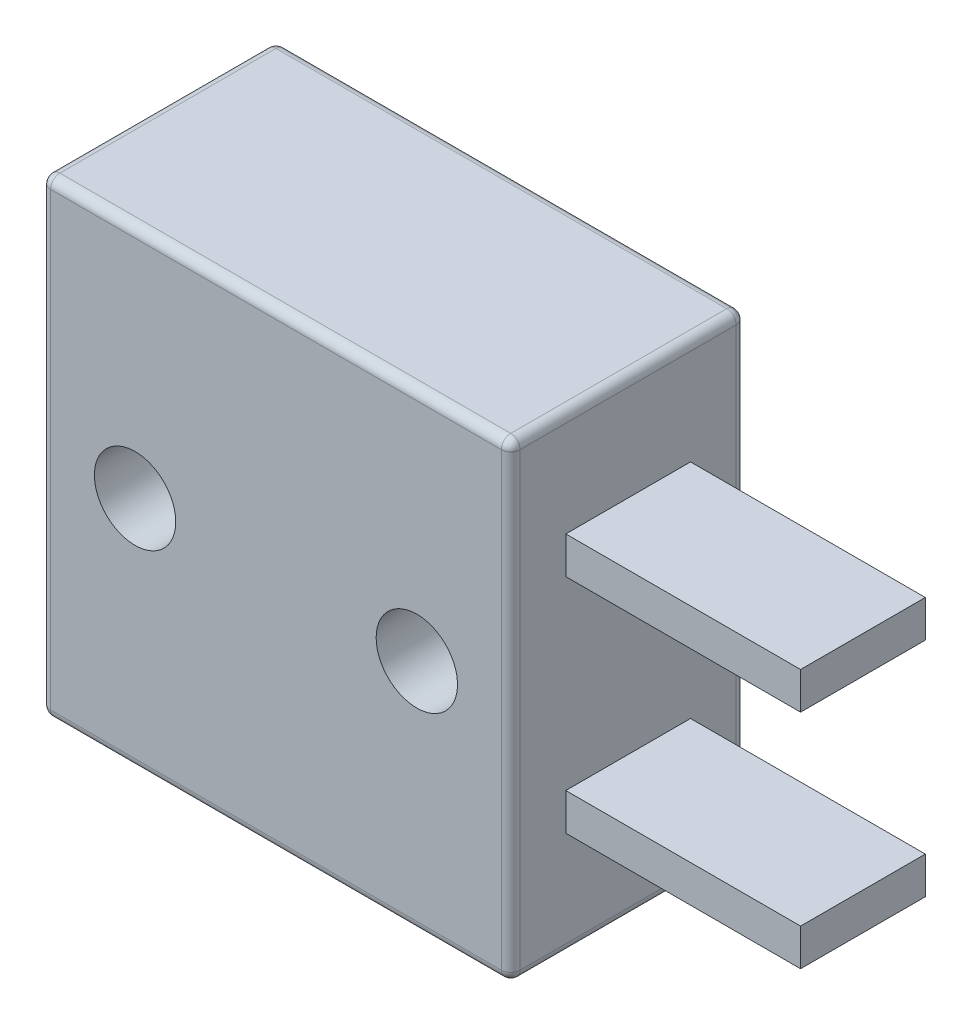
ISO-10303-21;
HEADER;
FILE_DESCRIPTION(('STEP AP214'),'2;1');
FILE_NAME('part.step','',(''),(''),'','','');
FILE_SCHEMA(('AUTOMOTIVE_DESIGN { 1 0 10303 214 1 1 1 1 }'));
ENDSEC;
DATA;
#1=APPLICATION_CONTEXT('core data for automotive mechanical design processes');
#2=APPLICATION_PROTOCOL_DEFINITION('international standard','automotive_design',2000,#1);
#3=PRODUCT_CONTEXT('',#1,'mechanical');
#4=PRODUCT('Part','Part','',(#3));
#5=PRODUCT_RELATED_PRODUCT_CATEGORY('part','',(#4));
#6=PRODUCT_DEFINITION_FORMATION('','',#4);
#7=PRODUCT_DEFINITION_CONTEXT('part definition',#1,'design');
#8=PRODUCT_DEFINITION('design','',#6,#7);
#9=PRODUCT_DEFINITION_SHAPE('','',#8);
#10=(LENGTH_UNIT() NAMED_UNIT(*) SI_UNIT(.MILLI.,.METRE.));
#11=(NAMED_UNIT(*) PLANE_ANGLE_UNIT() SI_UNIT($,.RADIAN.));
#12=(NAMED_UNIT(*) SI_UNIT($,.STERADIAN.) SOLID_ANGLE_UNIT());
#13=UNCERTAINTY_MEASURE_WITH_UNIT(LENGTH_MEASURE(1.E-05),#10,'distance_accuracy_value','');
#14=(GEOMETRIC_REPRESENTATION_CONTEXT(3) GLOBAL_UNCERTAINTY_ASSIGNED_CONTEXT((#13)) GLOBAL_UNIT_ASSIGNED_CONTEXT((#10,
#11,#12)) REPRESENTATION_CONTEXT('',''));
#15=CARTESIAN_POINT('',(0.,0.,0.));
#16=DIRECTION('',(0.,0.,1.));
#17=DIRECTION('',(1.,0.,0.));
#18=AXIS2_PLACEMENT_3D('',#15,#16,#17);
#19=CARTESIAN_POINT('',(0.,0.,6.35));
#20=DIRECTION('',(0.,0.,1.));
#21=DIRECTION('',(1.,0.,0.));
#22=AXIS2_PLACEMENT_3D('',#19,#20,#21);
#23=PLANE('',#22);
#24=DIRECTION('',(0.,-1.,0.));
#25=VECTOR('',#24,1.);
#26=CARTESIAN_POINT('',(-6.096,-6.35,6.35));
#27=LINE('',#26,#25);
#28=CARTESIAN_POINT('',(-6.096,6.096,6.35));
#29=VERTEX_POINT('',#28);
#30=CARTESIAN_POINT('',(-6.096,-6.096,6.35));
#31=VERTEX_POINT('',#30);
#32=EDGE_CURVE('E286',#29,#31,#27,.T.);
#33=ORIENTED_EDGE('',*,*,#32,.T.);
#34=DIRECTION('',(1.,0.,0.));
#35=VECTOR('',#34,1.);
#36=CARTESIAN_POINT('',(6.35,-6.096,6.35));
#37=LINE('',#36,#35);
#38=CARTESIAN_POINT('',(6.096,-6.096,6.35));
#39=VERTEX_POINT('',#38);
#40=EDGE_CURVE('E290',#31,#39,#37,.T.);
#41=ORIENTED_EDGE('',*,*,#40,.T.);
#42=DIRECTION('',(0.,1.,0.));
#43=VECTOR('',#42,1.);
#44=CARTESIAN_POINT('',(6.096,6.35,6.35));
#45=LINE('',#44,#43);
#46=CARTESIAN_POINT('',(6.096,6.096,6.35));
#47=VERTEX_POINT('',#46);
#48=EDGE_CURVE('E288',#39,#47,#45,.T.);
#49=ORIENTED_EDGE('',*,*,#48,.T.);
#50=DIRECTION('',(-1.,0.,0.));
#51=VECTOR('',#50,1.);
#52=CARTESIAN_POINT('',(-6.35,6.096,6.35));
#53=LINE('',#52,#51);
#54=EDGE_CURVE('E284',#47,#29,#53,.T.);
#55=ORIENTED_EDGE('',*,*,#54,.T.);
#56=EDGE_LOOP('',(#33,#41,#49,#55));
#57=FACE_BOUND('',#56,.T.);
#58=CARTESIAN_POINT('',(-3.81,0.,6.35));
#59=DIRECTION('',(0.,0.,1.));
#60=DIRECTION('',(1.,0.,0.));
#61=AXIS2_PLACEMENT_3D('',#58,#59,#60);
#62=CIRCLE('',#61,1.1);
#63=CARTESIAN_POINT('',(-2.71,0.,6.35));
#64=VERTEX_POINT('',#63);
#65=EDGE_CURVE('E243',#64,#64,#62,.T.);
#66=ORIENTED_EDGE('',*,*,#65,.F.);
#67=EDGE_LOOP('',(#66));
#68=FACE_BOUND('',#67,.T.);
#69=CARTESIAN_POINT('',(3.81,0.,6.35));
#70=DIRECTION('',(0.,0.,1.));
#71=DIRECTION('',(-1.,0.,0.));
#72=AXIS2_PLACEMENT_3D('',#69,#70,#71);
#73=CIRCLE('',#72,1.1);
#74=CARTESIAN_POINT('',(2.71,0.,6.35));
#75=VERTEX_POINT('',#74);
#76=EDGE_CURVE('E237',#75,#75,#73,.T.);
#77=ORIENTED_EDGE('',*,*,#76,.F.);
#78=EDGE_LOOP('',(#77));
#79=FACE_BOUND('',#78,.T.);
#80=ADVANCED_FACE('F39',(#57,#68,#79),#23,.T.);
#81=CARTESIAN_POINT('',(0.,0.,0.));
#82=DIRECTION('',(0.,0.,1.));
#83=DIRECTION('',(1.,0.,0.));
#84=AXIS2_PLACEMENT_3D('',#81,#82,#83);
#85=PLANE('',#84);
#86=DIRECTION('',(1.,0.,0.));
#87=VECTOR('',#86,1.);
#88=CARTESIAN_POINT('',(0.,-6.096,0.));
#89=LINE('',#88,#87);
#90=CARTESIAN_POINT('',(6.096,-6.096,0.));
#91=VERTEX_POINT('',#90);
#92=CARTESIAN_POINT('',(-6.096,-6.096,0.));
#93=VERTEX_POINT('',#92);
#94=EDGE_CURVE('E261',#91,#93,#89,.F.);
#95=ORIENTED_EDGE('',*,*,#94,.T.);
#96=DIRECTION('',(0.,-1.,0.));
#97=VECTOR('',#96,1.);
#98=CARTESIAN_POINT('',(-6.096,0.,0.));
#99=LINE('',#98,#97);
#100=CARTESIAN_POINT('',(-6.096,6.096,0.));
#101=VERTEX_POINT('',#100);
#102=EDGE_CURVE('E263',#93,#101,#99,.F.);
#103=ORIENTED_EDGE('',*,*,#102,.T.);
#104=DIRECTION('',(-1.,0.,0.));
#105=VECTOR('',#104,1.);
#106=CARTESIAN_POINT('',(0.,6.096,0.));
#107=LINE('',#106,#105);
#108=CARTESIAN_POINT('',(6.096,6.096,0.));
#109=VERTEX_POINT('',#108);
#110=EDGE_CURVE('E257',#101,#109,#107,.F.);
#111=ORIENTED_EDGE('',*,*,#110,.T.);
#112=DIRECTION('',(0.,1.,0.));
#113=VECTOR('',#112,1.);
#114=CARTESIAN_POINT('',(6.096,0.,0.));
#115=LINE('',#114,#113);
#116=EDGE_CURVE('E259',#109,#91,#115,.F.);
#117=ORIENTED_EDGE('',*,*,#116,.T.);
#118=EDGE_LOOP('',(#95,#103,#111,#117));
#119=FACE_BOUND('',#118,.T.);
#120=CARTESIAN_POINT('',(-3.81,0.,0.));
#121=DIRECTION('',(0.,0.,1.));
#122=DIRECTION('',(1.,0.,0.));
#123=AXIS2_PLACEMENT_3D('',#120,#121,#122);
#124=CIRCLE('',#123,1.1);
#125=CARTESIAN_POINT('',(-2.71,0.,0.));
#126=VERTEX_POINT('',#125);
#127=EDGE_CURVE('E240',#126,#126,#124,.T.);
#128=ORIENTED_EDGE('',*,*,#127,.T.);
#129=EDGE_LOOP('',(#128));
#130=FACE_BOUND('',#129,.T.);
#131=CARTESIAN_POINT('',(3.81,0.,0.));
#132=DIRECTION('',(0.,0.,1.));
#133=DIRECTION('',(-1.,0.,0.));
#134=AXIS2_PLACEMENT_3D('',#131,#132,#133);
#135=CIRCLE('',#134,1.1);
#136=CARTESIAN_POINT('',(2.71,0.,0.));
#137=VERTEX_POINT('',#136);
#138=EDGE_CURVE('E236',#137,#137,#135,.T.);
#139=ORIENTED_EDGE('',*,*,#138,.T.);
#140=EDGE_LOOP('',(#139));
#141=FACE_BOUND('',#140,.T.);
#142=ADVANCED_FACE('F400',(#119,#130,#141),#85,.F.);
#143=CARTESIAN_POINT('',(6.35,6.35,6.35));
#144=DIRECTION('',(-1.,0.,0.));
#145=DIRECTION('',(0.,0.,1.));
#146=AXIS2_PLACEMENT_3D('',#143,#144,#145);
#147=PLANE('',#146);
#148=DIRECTION('',(0.,0.,-1.));
#149=VECTOR('',#148,1.);
#150=CARTESIAN_POINT('',(6.35,-6.096,6.35));
#151=LINE('',#150,#149);
#152=CARTESIAN_POINT('',(6.35,-6.096,6.096));
#153=VERTEX_POINT('',#152);
#154=CARTESIAN_POINT('',(6.35,-6.096,0.254));
#155=VERTEX_POINT('',#154);
#156=EDGE_CURVE('E279',#153,#155,#151,.T.);
#157=ORIENTED_EDGE('',*,*,#156,.T.);
#158=DIRECTION('',(0.,1.,0.));
#159=VECTOR('',#158,1.);
#160=CARTESIAN_POINT('',(6.35,6.35,0.254));
#161=LINE('',#160,#159);
#162=CARTESIAN_POINT('',(6.35,6.096,0.254));
#163=VERTEX_POINT('',#162);
#164=EDGE_CURVE('E281',#155,#163,#161,.T.);
#165=ORIENTED_EDGE('',*,*,#164,.T.);
#166=DIRECTION('',(0.,0.,-1.));
#167=VECTOR('',#166,1.);
#168=CARTESIAN_POINT('',(6.35,6.096,6.35));
#169=LINE('',#168,#167);
#170=CARTESIAN_POINT('',(6.35,6.096,6.096));
#171=VERTEX_POINT('',#170);
#172=EDGE_CURVE('E275',#163,#171,#169,.F.);
#173=ORIENTED_EDGE('',*,*,#172,.T.);
#174=DIRECTION('',(0.,1.,0.));
#175=VECTOR('',#174,1.);
#176=CARTESIAN_POINT('',(6.35,-6.35,6.096));
#177=LINE('',#176,#175);
#178=EDGE_CURVE('E277',#171,#153,#177,.F.);
#179=ORIENTED_EDGE('',*,*,#178,.T.);
#180=EDGE_LOOP('',(#157,#165,#173,#179));
#181=FACE_BOUND('',#180,.T.);
#182=DIRECTION('',(0.,0.,-1.));
#183=VECTOR('',#182,1.);
#184=CARTESIAN_POINT('',(6.35,-3.5048,4.86171875));
#185=LINE('',#184,#183);
#186=CARTESIAN_POINT('',(6.35,-3.5048,4.86171875));
#187=VERTEX_POINT('',#186);
#188=CARTESIAN_POINT('',(6.35,-3.5048,1.48828125));
#189=VERTEX_POINT('',#188);
#190=EDGE_CURVE('E378',#187,#189,#185,.T.);
#191=ORIENTED_EDGE('',*,*,#190,.F.);
#192=DIRECTION('',(0.,-1.,0.));
#193=VECTOR('',#192,1.);
#194=CARTESIAN_POINT('',(6.35,-3.5048,4.86171875));
#195=LINE('',#194,#193);
#196=CARTESIAN_POINT('',(6.35,-2.5048,4.86171875));
#197=VERTEX_POINT('',#196);
#198=EDGE_CURVE('E193',#197,#187,#195,.T.);
#199=ORIENTED_EDGE('',*,*,#198,.F.);
#200=DIRECTION('',(0.,0.,-1.));
#201=VECTOR('',#200,1.);
#202=CARTESIAN_POINT('',(6.35,-2.5048,4.86171875));
#203=LINE('',#202,#201);
#204=CARTESIAN_POINT('',(6.35,-2.5048,1.48828125));
#205=VERTEX_POINT('',#204);
#206=EDGE_CURVE('E205',#197,#205,#203,.T.);
#207=ORIENTED_EDGE('',*,*,#206,.T.);
#208=DIRECTION('',(0.,-1.,0.));
#209=VECTOR('',#208,1.);
#210=CARTESIAN_POINT('',(6.35,-3.5048,1.48828125));
#211=LINE('',#210,#209);
#212=EDGE_CURVE('E196',#205,#189,#211,.T.);
#213=ORIENTED_EDGE('',*,*,#212,.T.);
#214=EDGE_LOOP('',(#191,#199,#207,#213));
#215=FACE_BOUND('',#214,.T.);
#216=DIRECTION('',(0.,0.,-1.));
#217=VECTOR('',#216,1.);
#218=CARTESIAN_POINT('',(6.35,2.5048,4.86171875));
#219=LINE('',#218,#217);
#220=CARTESIAN_POINT('',(6.35,2.5048,4.86171875));
#221=VERTEX_POINT('',#220);
#222=CARTESIAN_POINT('',(6.35,2.5048,1.48828125));
#223=VERTEX_POINT('',#222);
#224=EDGE_CURVE('E233',#221,#223,#219,.T.);
#225=ORIENTED_EDGE('',*,*,#224,.F.);
#226=DIRECTION('',(0.,-1.,0.));
#227=VECTOR('',#226,1.);
#228=CARTESIAN_POINT('',(6.35,3.5048,4.86171875));
#229=LINE('',#228,#227);
#230=CARTESIAN_POINT('',(6.35,3.5048,4.86171875));
#231=VERTEX_POINT('',#230);
#232=EDGE_CURVE('E209',#231,#221,#229,.T.);
#233=ORIENTED_EDGE('',*,*,#232,.F.);
#234=DIRECTION('',(0.,0.,-1.));
#235=VECTOR('',#234,1.);
#236=CARTESIAN_POINT('',(6.35,3.5048,4.86171875));
#237=LINE('',#236,#235);
#238=CARTESIAN_POINT('',(6.35,3.5048,1.48828125));
#239=VERTEX_POINT('',#238);
#240=EDGE_CURVE('E219',#231,#239,#237,.T.);
#241=ORIENTED_EDGE('',*,*,#240,.T.);
#242=DIRECTION('',(0.,-1.,0.));
#243=VECTOR('',#242,1.);
#244=CARTESIAN_POINT('',(6.35,3.5048,1.48828125));
#245=LINE('',#244,#243);
#246=EDGE_CURVE('E201',#239,#223,#245,.T.);
#247=ORIENTED_EDGE('',*,*,#246,.T.);
#248=EDGE_LOOP('',(#225,#233,#241,#247));
#249=FACE_BOUND('',#248,.T.);
#250=ADVANCED_FACE('F381',(#181,#215,#249),#147,.F.);
#251=CARTESIAN_POINT('',(-6.35,6.35,6.35));
#252=DIRECTION('',(0.,-1.,0.));
#253=DIRECTION('',(0.,0.,-1.));
#254=AXIS2_PLACEMENT_3D('',#251,#252,#253);
#255=PLANE('',#254);
#256=DIRECTION('',(-1.,0.,0.));
#257=VECTOR('',#256,1.);
#258=CARTESIAN_POINT('',(-6.35,6.35,0.254));
#259=LINE('',#258,#257);
#260=CARTESIAN_POINT('',(6.096,6.35,0.254));
#261=VERTEX_POINT('',#260);
#262=CARTESIAN_POINT('',(-6.096,6.35,0.254));
#263=VERTEX_POINT('',#262);
#264=EDGE_CURVE('E48',#261,#263,#259,.T.);
#265=ORIENTED_EDGE('',*,*,#264,.T.);
#266=DIRECTION('',(0.,0.,-1.));
#267=VECTOR('',#266,1.);
#268=CARTESIAN_POINT('',(-6.096,6.35,6.35));
#269=LINE('',#268,#267);
#270=CARTESIAN_POINT('',(-6.096,6.35,6.096));
#271=VERTEX_POINT('',#270);
#272=EDGE_CURVE('E11',#263,#271,#269,.F.);
#273=ORIENTED_EDGE('',*,*,#272,.T.);
#274=DIRECTION('',(-1.,0.,0.));
#275=VECTOR('',#274,1.);
#276=CARTESIAN_POINT('',(6.35,6.35,6.096));
#277=LINE('',#276,#275);
#278=CARTESIAN_POINT('',(6.096,6.35,6.096));
#279=VERTEX_POINT('',#278);
#280=EDGE_CURVE('E293',#271,#279,#277,.F.);
#281=ORIENTED_EDGE('',*,*,#280,.T.);
#282=DIRECTION('',(0.,0.,-1.));
#283=VECTOR('',#282,1.);
#284=CARTESIAN_POINT('',(6.096,6.35,6.35));
#285=LINE('',#284,#283);
#286=EDGE_CURVE('E59',#279,#261,#285,.T.);
#287=ORIENTED_EDGE('',*,*,#286,.T.);
#288=EDGE_LOOP('',(#265,#273,#281,#287));
#289=FACE_BOUND('',#288,.T.);
#290=ADVANCED_FACE('F420',(#289),#255,.F.);
#291=CARTESIAN_POINT('',(-6.35,6.35,6.35));
#292=DIRECTION('',(1.,0.,0.));
#293=DIRECTION('',(0.,1.,0.));
#294=AXIS2_PLACEMENT_3D('',#291,#292,#293);
#295=PLANE('',#294);
#296=DIRECTION('',(0.,0.,-1.));
#297=VECTOR('',#296,1.);
#298=CARTESIAN_POINT('',(-6.35,6.096,6.35));
#299=LINE('',#298,#297);
#300=CARTESIAN_POINT('',(-6.35,6.096,6.096));
#301=VERTEX_POINT('',#300);
#302=CARTESIAN_POINT('',(-6.35,6.096,0.254));
#303=VERTEX_POINT('',#302);
#304=EDGE_CURVE('E246',#301,#303,#299,.T.);
#305=ORIENTED_EDGE('',*,*,#304,.T.);
#306=DIRECTION('',(0.,-1.,0.));
#307=VECTOR('',#306,1.);
#308=CARTESIAN_POINT('',(-6.35,6.35,0.254));
#309=LINE('',#308,#307);
#310=CARTESIAN_POINT('',(-6.35,-6.096,0.254));
#311=VERTEX_POINT('',#310);
#312=EDGE_CURVE('E254',#303,#311,#309,.T.);
#313=ORIENTED_EDGE('',*,*,#312,.T.);
#314=DIRECTION('',(0.,0.,-1.));
#315=VECTOR('',#314,1.);
#316=CARTESIAN_POINT('',(-6.35,-6.096,6.35));
#317=LINE('',#316,#315);
#318=CARTESIAN_POINT('',(-6.35,-6.096,6.096));
#319=VERTEX_POINT('',#318);
#320=EDGE_CURVE('E252',#311,#319,#317,.F.);
#321=ORIENTED_EDGE('',*,*,#320,.T.);
#322=DIRECTION('',(0.,-1.,0.));
#323=VECTOR('',#322,1.);
#324=CARTESIAN_POINT('',(-6.35,6.35,6.096));
#325=LINE('',#324,#323);
#326=EDGE_CURVE('E250',#319,#301,#325,.F.);
#327=ORIENTED_EDGE('',*,*,#326,.T.);
#328=EDGE_LOOP('',(#305,#313,#321,#327));
#329=FACE_BOUND('',#328,.T.);
#330=ADVANCED_FACE('F416',(#329),#295,.F.);
#331=CARTESIAN_POINT('',(-6.35,-6.35,6.35));
#332=DIRECTION('',(0.,1.,0.));
#333=DIRECTION('',(0.,0.,1.));
#334=AXIS2_PLACEMENT_3D('',#331,#332,#333);
#335=PLANE('',#334);
#336=DIRECTION('',(1.,0.,0.));
#337=VECTOR('',#336,1.);
#338=CARTESIAN_POINT('',(-6.35,-6.35,6.096));
#339=LINE('',#338,#337);
#340=CARTESIAN_POINT('',(6.096,-6.35,6.096));
#341=VERTEX_POINT('',#340);
#342=CARTESIAN_POINT('',(-6.096,-6.35,6.096));
#343=VERTEX_POINT('',#342);
#344=EDGE_CURVE('E266',#341,#343,#339,.F.);
#345=ORIENTED_EDGE('',*,*,#344,.T.);
#346=DIRECTION('',(0.,0.,-1.));
#347=VECTOR('',#346,1.);
#348=CARTESIAN_POINT('',(-6.096,-6.35,6.35));
#349=LINE('',#348,#347);
#350=CARTESIAN_POINT('',(-6.096,-6.35,0.254));
#351=VERTEX_POINT('',#350);
#352=EDGE_CURVE('E272',#343,#351,#349,.T.);
#353=ORIENTED_EDGE('',*,*,#352,.T.);
#354=DIRECTION('',(1.,0.,0.));
#355=VECTOR('',#354,1.);
#356=CARTESIAN_POINT('',(-6.35,-6.35,0.254));
#357=LINE('',#356,#355);
#358=CARTESIAN_POINT('',(6.096,-6.35,0.254));
#359=VERTEX_POINT('',#358);
#360=EDGE_CURVE('E270',#351,#359,#357,.T.);
#361=ORIENTED_EDGE('',*,*,#360,.T.);
#362=DIRECTION('',(0.,0.,-1.));
#363=VECTOR('',#362,1.);
#364=CARTESIAN_POINT('',(6.096,-6.35,6.35));
#365=LINE('',#364,#363);
#366=EDGE_CURVE('E268',#359,#341,#365,.F.);
#367=ORIENTED_EDGE('',*,*,#366,.T.);
#368=EDGE_LOOP('',(#345,#353,#361,#367));
#369=FACE_BOUND('',#368,.T.);
#370=ADVANCED_FACE('F413',(#369),#335,.F.);
#371=CARTESIAN_POINT('',(-3.81,0.,6.35));
#372=DIRECTION('',(0.,0.,-1.));
#373=DIRECTION('',(-1.,0.,0.));
#374=AXIS2_PLACEMENT_3D('',#371,#372,#373);
#375=CYLINDRICAL_SURFACE('',#374,1.1);
#376=ORIENTED_EDGE('',*,*,#65,.T.);
#377=EDGE_LOOP('',(#376));
#378=FACE_BOUND('',#377,.T.);
#379=ORIENTED_EDGE('',*,*,#127,.F.);
#380=EDGE_LOOP('',(#379));
#381=FACE_BOUND('',#380,.T.);
#382=ADVANCED_FACE('F410',(#378,#381),#375,.F.);
#383=CARTESIAN_POINT('',(3.81,0.,6.35));
#384=DIRECTION('',(0.,0.,-1.));
#385=DIRECTION('',(-1.,0.,0.));
#386=AXIS2_PLACEMENT_3D('',#383,#384,#385);
#387=CYLINDRICAL_SURFACE('',#386,1.1);
#388=ORIENTED_EDGE('',*,*,#76,.T.);
#389=EDGE_LOOP('',(#388));
#390=FACE_BOUND('',#389,.T.);
#391=ORIENTED_EDGE('',*,*,#138,.F.);
#392=EDGE_LOOP('',(#391));
#393=FACE_BOUND('',#392,.T.);
#394=ADVANCED_FACE('F542',(#390,#393),#387,.F.);
#395=CARTESIAN_POINT('',(6.35,2.5048,4.86171875));
#396=DIRECTION('',(0.,1.,0.));
#397=DIRECTION('',(0.,0.,1.));
#398=AXIS2_PLACEMENT_3D('',#395,#396,#397);
#399=PLANE('',#398);
#400=DIRECTION('',(1.,0.,0.));
#401=VECTOR('',#400,1.);
#402=CARTESIAN_POINT('',(6.35,2.5048,1.48828125));
#403=LINE('',#402,#401);
#404=CARTESIAN_POINT('',(12.7,2.5048,1.48828125));
#405=VERTEX_POINT('',#404);
#406=EDGE_CURVE('E203',#223,#405,#403,.T.);
#407=ORIENTED_EDGE('',*,*,#406,.T.);
#408=DIRECTION('',(0.,0.,-1.));
#409=VECTOR('',#408,1.);
#410=CARTESIAN_POINT('',(12.7,2.5048,4.86171875));
#411=LINE('',#410,#409);
#412=CARTESIAN_POINT('',(12.7,2.5048,4.86171875));
#413=VERTEX_POINT('',#412);
#414=EDGE_CURVE('E230',#413,#405,#411,.T.);
#415=ORIENTED_EDGE('',*,*,#414,.F.);
#416=DIRECTION('',(1.,0.,0.));
#417=VECTOR('',#416,1.);
#418=CARTESIAN_POINT('',(6.35,2.5048,4.86171875));
#419=LINE('',#418,#417);
#420=EDGE_CURVE('E212',#221,#413,#419,.T.);
#421=ORIENTED_EDGE('',*,*,#420,.F.);
#422=ORIENTED_EDGE('',*,*,#224,.T.);
#423=EDGE_LOOP('',(#407,#415,#421,#422));
#424=FACE_BOUND('',#423,.T.);
#425=ADVANCED_FACE('F544',(#424),#399,.F.);
#426=CARTESIAN_POINT('',(12.7,3.5048,4.86171875));
#427=DIRECTION('',(-1.,0.,0.));
#428=DIRECTION('',(0.,0.,1.));
#429=AXIS2_PLACEMENT_3D('',#426,#427,#428);
#430=PLANE('',#429);
#431=DIRECTION('',(0.,1.,0.));
#432=VECTOR('',#431,1.);
#433=CARTESIAN_POINT('',(12.7,3.5048,1.48828125));
#434=LINE('',#433,#432);
#435=CARTESIAN_POINT('',(12.7,3.5048,1.48828125));
#436=VERTEX_POINT('',#435);
#437=EDGE_CURVE('E222',#405,#436,#434,.T.);
#438=ORIENTED_EDGE('',*,*,#437,.T.);
#439=DIRECTION('',(0.,0.,-1.));
#440=VECTOR('',#439,1.);
#441=CARTESIAN_POINT('',(12.7,3.5048,4.86171875));
#442=LINE('',#441,#440);
#443=CARTESIAN_POINT('',(12.7,3.5048,4.86171875));
#444=VERTEX_POINT('',#443);
#445=EDGE_CURVE('E227',#444,#436,#442,.T.);
#446=ORIENTED_EDGE('',*,*,#445,.F.);
#447=DIRECTION('',(0.,1.,0.));
#448=VECTOR('',#447,1.);
#449=CARTESIAN_POINT('',(12.7,3.5048,4.86171875));
#450=LINE('',#449,#448);
#451=EDGE_CURVE('E215',#413,#444,#450,.T.);
#452=ORIENTED_EDGE('',*,*,#451,.F.);
#453=ORIENTED_EDGE('',*,*,#414,.T.);
#454=EDGE_LOOP('',(#438,#446,#452,#453));
#455=FACE_BOUND('',#454,.T.);
#456=ADVANCED_FACE('F550',(#455),#430,.F.);
#457=CARTESIAN_POINT('',(6.35,3.5048,4.86171875));
#458=DIRECTION('',(0.,-1.,0.));
#459=DIRECTION('',(0.,0.,-1.));
#460=AXIS2_PLACEMENT_3D('',#457,#458,#459);
#461=PLANE('',#460);
#462=DIRECTION('',(-1.,0.,0.));
#463=VECTOR('',#462,1.);
#464=CARTESIAN_POINT('',(6.35,3.5048,1.48828125));
#465=LINE('',#464,#463);
#466=EDGE_CURVE('E213',#436,#239,#465,.T.);
#467=ORIENTED_EDGE('',*,*,#466,.T.);
#468=ORIENTED_EDGE('',*,*,#240,.F.);
#469=DIRECTION('',(-1.,0.,0.));
#470=VECTOR('',#469,1.);
#471=CARTESIAN_POINT('',(6.35,3.5048,4.86171875));
#472=LINE('',#471,#470);
#473=EDGE_CURVE('E217',#444,#231,#472,.T.);
#474=ORIENTED_EDGE('',*,*,#473,.F.);
#475=ORIENTED_EDGE('',*,*,#445,.T.);
#476=EDGE_LOOP('',(#467,#468,#474,#475));
#477=FACE_BOUND('',#476,.T.);
#478=ADVANCED_FACE('F557',(#477),#461,.F.);
#479=CARTESIAN_POINT('',(0.,0.,4.86171875));
#480=DIRECTION('',(0.,0.,1.));
#481=DIRECTION('',(1.,0.,0.));
#482=AXIS2_PLACEMENT_3D('',#479,#480,#481);
#483=PLANE('',#482);
#484=ORIENTED_EDGE('',*,*,#232,.T.);
#485=ORIENTED_EDGE('',*,*,#420,.T.);
#486=ORIENTED_EDGE('',*,*,#451,.T.);
#487=ORIENTED_EDGE('',*,*,#473,.T.);
#488=EDGE_LOOP('',(#484,#485,#486,#487));
#489=FACE_BOUND('',#488,.T.);
#490=ADVANCED_FACE('F561',(#489),#483,.T.);
#491=CARTESIAN_POINT('',(0.,0.,1.48828125));
#492=DIRECTION('',(0.,0.,1.));
#493=DIRECTION('',(1.,0.,0.));
#494=AXIS2_PLACEMENT_3D('',#491,#492,#493);
#495=PLANE('',#494);
#496=ORIENTED_EDGE('',*,*,#246,.F.);
#497=ORIENTED_EDGE('',*,*,#466,.F.);
#498=ORIENTED_EDGE('',*,*,#437,.F.);
#499=ORIENTED_EDGE('',*,*,#406,.F.);
#500=EDGE_LOOP('',(#496,#497,#498,#499));
#501=FACE_BOUND('',#500,.T.);
#502=ADVANCED_FACE('F563',(#501),#495,.F.);
#503=CARTESIAN_POINT('',(6.35,-3.5048,4.86171875));
#504=DIRECTION('',(0.,1.,0.));
#505=DIRECTION('',(-1.,0.,0.));
#506=AXIS2_PLACEMENT_3D('',#503,#504,#505);
#507=PLANE('',#506);
#508=DIRECTION('',(1.,0.,0.));
#509=VECTOR('',#508,1.);
#510=CARTESIAN_POINT('',(6.35,-3.5048,1.48828125));
#511=LINE('',#510,#509);
#512=CARTESIAN_POINT('',(12.7,-3.5048,1.48828125));
#513=VERTEX_POINT('',#512);
#514=EDGE_CURVE('E200',#189,#513,#511,.T.);
#515=ORIENTED_EDGE('',*,*,#514,.T.);
#516=DIRECTION('',(0.,0.,-1.));
#517=VECTOR('',#516,1.);
#518=CARTESIAN_POINT('',(12.7,-3.5048,4.86171875));
#519=LINE('',#518,#517);
#520=CARTESIAN_POINT('',(12.7,-3.5048,4.86171875));
#521=VERTEX_POINT('',#520);
#522=EDGE_CURVE('E180',#521,#513,#519,.T.);
#523=ORIENTED_EDGE('',*,*,#522,.F.);
#524=DIRECTION('',(1.,0.,0.));
#525=VECTOR('',#524,1.);
#526=CARTESIAN_POINT('',(6.35,-3.5048,4.86171875));
#527=LINE('',#526,#525);
#528=EDGE_CURVE('E188',#187,#521,#527,.T.);
#529=ORIENTED_EDGE('',*,*,#528,.F.);
#530=ORIENTED_EDGE('',*,*,#190,.T.);
#531=EDGE_LOOP('',(#515,#523,#529,#530));
#532=FACE_BOUND('',#531,.T.);
#533=ADVANCED_FACE('F198',(#532),#507,.F.);
#534=CARTESIAN_POINT('',(12.7,-3.5048,4.86171875));
#535=DIRECTION('',(-1.,0.,0.));
#536=DIRECTION('',(0.,0.,1.));
#537=AXIS2_PLACEMENT_3D('',#534,#535,#536);
#538=PLANE('',#537);
#539=DIRECTION('',(0.,1.,0.));
#540=VECTOR('',#539,1.);
#541=CARTESIAN_POINT('',(12.7,-3.5048,1.48828125));
#542=LINE('',#541,#540);
#543=CARTESIAN_POINT('',(12.7,-2.5048,1.48828125));
#544=VERTEX_POINT('',#543);
#545=EDGE_CURVE('E368',#513,#544,#542,.T.);
#546=ORIENTED_EDGE('',*,*,#545,.T.);
#547=DIRECTION('',(0.,0.,-1.));
#548=VECTOR('',#547,1.);
#549=CARTESIAN_POINT('',(12.7,-2.5048,4.86171875));
#550=LINE('',#549,#548);
#551=CARTESIAN_POINT('',(12.7,-2.5048,4.86171875));
#552=VERTEX_POINT('',#551);
#553=EDGE_CURVE('E183',#552,#544,#550,.T.);
#554=ORIENTED_EDGE('',*,*,#553,.F.);
#555=DIRECTION('',(0.,1.,0.));
#556=VECTOR('',#555,1.);
#557=CARTESIAN_POINT('',(12.7,-3.5048,4.86171875));
#558=LINE('',#557,#556);
#559=EDGE_CURVE('E176',#521,#552,#558,.T.);
#560=ORIENTED_EDGE('',*,*,#559,.F.);
#561=ORIENTED_EDGE('',*,*,#522,.T.);
#562=EDGE_LOOP('',(#546,#554,#560,#561));
#563=FACE_BOUND('',#562,.T.);
#564=ADVANCED_FACE('F178',(#563),#538,.F.);
#565=CARTESIAN_POINT('',(6.35,-2.5048,4.86171875));
#566=DIRECTION('',(0.,-1.,0.));
#567=DIRECTION('',(1.,0.,0.));
#568=AXIS2_PLACEMENT_3D('',#565,#566,#567);
#569=PLANE('',#568);
#570=DIRECTION('',(-1.,0.,0.));
#571=VECTOR('',#570,1.);
#572=CARTESIAN_POINT('',(6.35,-2.5048,1.48828125));
#573=LINE('',#572,#571);
#574=EDGE_CURVE('E370',#544,#205,#573,.T.);
#575=ORIENTED_EDGE('',*,*,#574,.T.);
#576=ORIENTED_EDGE('',*,*,#206,.F.);
#577=DIRECTION('',(-1.,0.,0.));
#578=VECTOR('',#577,1.);
#579=CARTESIAN_POINT('',(6.35,-2.5048,4.86171875));
#580=LINE('',#579,#578);
#581=EDGE_CURVE('E187',#552,#197,#580,.T.);
#582=ORIENTED_EDGE('',*,*,#581,.F.);
#583=ORIENTED_EDGE('',*,*,#553,.T.);
#584=EDGE_LOOP('',(#575,#576,#582,#583));
#585=FACE_BOUND('',#584,.T.);
#586=ADVANCED_FACE('F386',(#585),#569,.F.);
#587=CARTESIAN_POINT('',(0.,0.,4.86171875));
#588=DIRECTION('',(0.,0.,1.));
#589=DIRECTION('',(1.,0.,0.));
#590=AXIS2_PLACEMENT_3D('',#587,#588,#589);
#591=PLANE('',#590);
#592=ORIENTED_EDGE('',*,*,#528,.T.);
#593=ORIENTED_EDGE('',*,*,#559,.T.);
#594=ORIENTED_EDGE('',*,*,#581,.T.);
#595=ORIENTED_EDGE('',*,*,#198,.T.);
#596=EDGE_LOOP('',(#592,#593,#594,#595));
#597=FACE_BOUND('',#596,.T.);
#598=ADVANCED_FACE('F192',(#597),#591,.T.);
#599=CARTESIAN_POINT('',(0.,0.,1.48828125));
#600=DIRECTION('',(0.,0.,1.));
#601=DIRECTION('',(1.,0.,0.));
#602=AXIS2_PLACEMENT_3D('',#599,#600,#601);
#603=PLANE('',#602);
#604=ORIENTED_EDGE('',*,*,#514,.F.);
#605=ORIENTED_EDGE('',*,*,#212,.F.);
#606=ORIENTED_EDGE('',*,*,#574,.F.);
#607=ORIENTED_EDGE('',*,*,#545,.F.);
#608=EDGE_LOOP('',(#604,#605,#606,#607));
#609=FACE_BOUND('',#608,.T.);
#610=ADVANCED_FACE('F388',(#609),#603,.F.);
#611=CARTESIAN_POINT('',(6.096,0.,6.096));
#612=DIRECTION('',(0.,-1.,0.));
#613=DIRECTION('',(0.,0.,-1.));
#614=AXIS2_PLACEMENT_3D('',#611,#612,#613);
#615=CYLINDRICAL_SURFACE('',#614,0.254);
#616=CARTESIAN_POINT('',(6.096,6.096,6.096));
#617=DIRECTION('',(0.,1.,0.));
#618=DIRECTION('',(0.,0.,1.));
#619=AXIS2_PLACEMENT_3D('',#616,#617,#618);
#620=CIRCLE('',#619,0.254);
#621=EDGE_CURVE('E43',#47,#171,#620,.T.);
#622=ORIENTED_EDGE('',*,*,#621,.F.);
#623=ORIENTED_EDGE('',*,*,#48,.F.);
#624=CARTESIAN_POINT('',(6.096,-6.096,6.096));
#625=DIRECTION('',(0.,-1.,0.));
#626=DIRECTION('',(0.,0.,-1.));
#627=AXIS2_PLACEMENT_3D('',#624,#625,#626);
#628=CIRCLE('',#627,0.254);
#629=EDGE_CURVE('E356',#153,#39,#628,.T.);
#630=ORIENTED_EDGE('',*,*,#629,.F.);
#631=ORIENTED_EDGE('',*,*,#178,.F.);
#632=EDGE_LOOP('',(#622,#623,#630,#631));
#633=FACE_BOUND('',#632,.T.);
#634=ADVANCED_FACE('F41',(#633),#615,.T.);
#635=CARTESIAN_POINT('',(6.096,6.096,6.096));
#636=DIRECTION('',(1.,0.,0.));
#637=DIRECTION('',(0.,0.,-1.));
#638=AXIS2_PLACEMENT_3D('',#635,#636,#637);
#639=SPHERICAL_SURFACE('',#638,0.254);
#640=CARTESIAN_POINT('',(6.096,6.096,6.096));
#641=DIRECTION('',(1.,0.,0.));
#642=DIRECTION('',(0.,0.,-1.));
#643=AXIS2_PLACEMENT_3D('',#640,#641,#642);
#644=CIRCLE('',#643,0.254);
#645=EDGE_CURVE('E351',#47,#279,#644,.F.);
#646=ORIENTED_EDGE('',*,*,#645,.F.);
#647=ORIENTED_EDGE('',*,*,#621,.T.);
#648=CARTESIAN_POINT('',(6.096,6.096,6.096));
#649=DIRECTION('',(0.,0.,1.));
#650=DIRECTION('',(1.,0.,0.));
#651=AXIS2_PLACEMENT_3D('',#648,#649,#650);
#652=CIRCLE('',#651,0.254);
#653=EDGE_CURVE('E354',#279,#171,#652,.F.);
#654=ORIENTED_EDGE('',*,*,#653,.F.);
#655=EDGE_LOOP('',(#646,#647,#654));
#656=FACE_BOUND('',#655,.T.);
#657=ADVANCED_FACE('F396',(#656),#639,.T.);
#658=CARTESIAN_POINT('',(6.096,-6.096,6.096));
#659=DIRECTION('',(0.,0.,1.));
#660=DIRECTION('',(1.,0.,0.));
#661=AXIS2_PLACEMENT_3D('',#658,#659,#660);
#662=SPHERICAL_SURFACE('',#661,0.254);
#663=CARTESIAN_POINT('',(6.096,-6.096,6.096));
#664=DIRECTION('',(0.,0.,1.));
#665=DIRECTION('',(1.,0.,0.));
#666=AXIS2_PLACEMENT_3D('',#663,#664,#665);
#667=CIRCLE('',#666,0.254);
#668=EDGE_CURVE('E346',#153,#341,#667,.F.);
#669=ORIENTED_EDGE('',*,*,#668,.F.);
#670=ORIENTED_EDGE('',*,*,#629,.T.);
#671=CARTESIAN_POINT('',(6.096,-6.096,6.096));
#672=DIRECTION('',(1.,0.,0.));
#673=DIRECTION('',(0.,0.,-1.));
#674=AXIS2_PLACEMENT_3D('',#671,#672,#673);
#675=CIRCLE('',#674,0.254);
#676=EDGE_CURVE('E349',#341,#39,#675,.F.);
#677=ORIENTED_EDGE('',*,*,#676,.F.);
#678=EDGE_LOOP('',(#669,#670,#677));
#679=FACE_BOUND('',#678,.T.);
#680=ADVANCED_FACE('F494',(#679),#662,.T.);
#681=CARTESIAN_POINT('',(6.096,6.096,6.35));
#682=DIRECTION('',(0.,0.,-1.));
#683=DIRECTION('',(-1.,0.,0.));
#684=AXIS2_PLACEMENT_3D('',#681,#682,#683);
#685=CYLINDRICAL_SURFACE('',#684,0.254);
#686=ORIENTED_EDGE('',*,*,#653,.T.);
#687=ORIENTED_EDGE('',*,*,#172,.F.);
#688=CARTESIAN_POINT('',(6.096,6.096,0.254));
#689=DIRECTION('',(0.,0.,-1.));
#690=DIRECTION('',(-1.,0.,0.));
#691=AXIS2_PLACEMENT_3D('',#688,#689,#690);
#692=CIRCLE('',#691,0.254);
#693=EDGE_CURVE('E341',#261,#163,#692,.T.);
#694=ORIENTED_EDGE('',*,*,#693,.F.);
#695=ORIENTED_EDGE('',*,*,#286,.F.);
#696=EDGE_LOOP('',(#686,#687,#694,#695));
#697=FACE_BOUND('',#696,.T.);
#698=ADVANCED_FACE('F490',(#697),#685,.T.);
#699=CARTESIAN_POINT('',(0.,6.096,6.096));
#700=DIRECTION('',(1.,0.,0.));
#701=DIRECTION('',(0.,0.,-1.));
#702=AXIS2_PLACEMENT_3D('',#699,#700,#701);
#703=CYLINDRICAL_SURFACE('',#702,0.254);
#704=ORIENTED_EDGE('',*,*,#645,.T.);
#705=ORIENTED_EDGE('',*,*,#280,.F.);
#706=CARTESIAN_POINT('',(-6.096,6.096,6.096));
#707=DIRECTION('',(-1.,0.,0.));
#708=DIRECTION('',(0.,0.,1.));
#709=AXIS2_PLACEMENT_3D('',#706,#707,#708);
#710=CIRCLE('',#709,0.254);
#711=EDGE_CURVE('E338',#29,#271,#710,.T.);
#712=ORIENTED_EDGE('',*,*,#711,.F.);
#713=ORIENTED_EDGE('',*,*,#54,.F.);
#714=EDGE_LOOP('',(#704,#705,#712,#713));
#715=FACE_BOUND('',#714,.T.);
#716=ADVANCED_FACE('F486',(#715),#703,.T.);
#717=CARTESIAN_POINT('',(-6.096,0.,6.096));
#718=DIRECTION('',(0.,1.,0.));
#719=DIRECTION('',(-1.,0.,0.));
#720=AXIS2_PLACEMENT_3D('',#717,#718,#719);
#721=CYLINDRICAL_SURFACE('',#720,0.254);
#722=CARTESIAN_POINT('',(-6.096,-6.096,6.096));
#723=DIRECTION('',(0.,-1.,0.));
#724=DIRECTION('',(0.,0.,-1.));
#725=AXIS2_PLACEMENT_3D('',#722,#723,#724);
#726=CIRCLE('',#725,0.254);
#727=EDGE_CURVE('E332',#31,#319,#726,.T.);
#728=ORIENTED_EDGE('',*,*,#727,.F.);
#729=ORIENTED_EDGE('',*,*,#32,.F.);
#730=CARTESIAN_POINT('',(-6.096,6.096,6.096));
#731=DIRECTION('',(0.,1.,0.));
#732=DIRECTION('',(0.,0.,1.));
#733=AXIS2_PLACEMENT_3D('',#730,#731,#732);
#734=CIRCLE('',#733,0.254);
#735=EDGE_CURVE('E335',#301,#29,#734,.T.);
#736=ORIENTED_EDGE('',*,*,#735,.F.);
#737=ORIENTED_EDGE('',*,*,#326,.F.);
#738=EDGE_LOOP('',(#728,#729,#736,#737));
#739=FACE_BOUND('',#738,.T.);
#740=ADVANCED_FACE('F482',(#739),#721,.T.);
#741=CARTESIAN_POINT('',(0.,-6.096,6.096));
#742=DIRECTION('',(-1.,0.,0.));
#743=DIRECTION('',(0.,0.,1.));
#744=AXIS2_PLACEMENT_3D('',#741,#742,#743);
#745=CYLINDRICAL_SURFACE('',#744,0.254);
#746=ORIENTED_EDGE('',*,*,#676,.T.);
#747=ORIENTED_EDGE('',*,*,#40,.F.);
#748=CARTESIAN_POINT('',(-6.096,-6.096,6.096));
#749=DIRECTION('',(-1.,0.,0.));
#750=DIRECTION('',(0.,0.,1.));
#751=AXIS2_PLACEMENT_3D('',#748,#749,#750);
#752=CIRCLE('',#751,0.254);
#753=EDGE_CURVE('E329',#343,#31,#752,.T.);
#754=ORIENTED_EDGE('',*,*,#753,.F.);
#755=ORIENTED_EDGE('',*,*,#344,.F.);
#756=EDGE_LOOP('',(#746,#747,#754,#755));
#757=FACE_BOUND('',#756,.T.);
#758=ADVANCED_FACE('F478',(#757),#745,.T.);
#759=CARTESIAN_POINT('',(6.096,-6.096,6.35));
#760=DIRECTION('',(0.,0.,-1.));
#761=DIRECTION('',(-1.,0.,0.));
#762=AXIS2_PLACEMENT_3D('',#759,#760,#761);
#763=CYLINDRICAL_SURFACE('',#762,0.254);
#764=ORIENTED_EDGE('',*,*,#668,.T.);
#765=ORIENTED_EDGE('',*,*,#366,.F.);
#766=CARTESIAN_POINT('',(6.096,-6.096,0.254));
#767=DIRECTION('',(0.,0.,-1.));
#768=DIRECTION('',(-1.,0.,0.));
#769=AXIS2_PLACEMENT_3D('',#766,#767,#768);
#770=CIRCLE('',#769,0.254);
#771=EDGE_CURVE('E326',#155,#359,#770,.T.);
#772=ORIENTED_EDGE('',*,*,#771,.F.);
#773=ORIENTED_EDGE('',*,*,#156,.F.);
#774=EDGE_LOOP('',(#764,#765,#772,#773));
#775=FACE_BOUND('',#774,.T.);
#776=ADVANCED_FACE('F474',(#775),#763,.T.);
#777=CARTESIAN_POINT('',(6.096,6.35,0.254));
#778=DIRECTION('',(0.,1.,0.));
#779=DIRECTION('',(0.,0.,1.));
#780=AXIS2_PLACEMENT_3D('',#777,#778,#779);
#781=CYLINDRICAL_SURFACE('',#780,0.254);
#782=CARTESIAN_POINT('',(6.096,6.096,0.254));
#783=DIRECTION('',(0.,1.,0.));
#784=DIRECTION('',(0.,0.,1.));
#785=AXIS2_PLACEMENT_3D('',#782,#783,#784);
#786=CIRCLE('',#785,0.254);
#787=EDGE_CURVE('E343',#163,#109,#786,.T.);
#788=ORIENTED_EDGE('',*,*,#787,.F.);
#789=ORIENTED_EDGE('',*,*,#164,.F.);
#790=CARTESIAN_POINT('',(6.096,-6.096,0.254));
#791=DIRECTION('',(0.,-1.,0.));
#792=DIRECTION('',(1.,0.,0.));
#793=AXIS2_PLACEMENT_3D('',#790,#791,#792);
#794=CIRCLE('',#793,0.254);
#795=EDGE_CURVE('E323',#91,#155,#794,.T.);
#796=ORIENTED_EDGE('',*,*,#795,.F.);
#797=ORIENTED_EDGE('',*,*,#116,.F.);
#798=EDGE_LOOP('',(#788,#789,#796,#797));
#799=FACE_BOUND('',#798,.T.);
#800=ADVANCED_FACE('F470',(#799),#781,.T.);
#801=CARTESIAN_POINT('',(6.096,6.096,0.254));
#802=DIRECTION('',(1.,0.,0.));
#803=DIRECTION('',(0.,0.,-1.));
#804=AXIS2_PLACEMENT_3D('',#801,#802,#803);
#805=SPHERICAL_SURFACE('',#804,0.254);
#806=ORIENTED_EDGE('',*,*,#693,.T.);
#807=ORIENTED_EDGE('',*,*,#787,.T.);
#808=CARTESIAN_POINT('',(6.096,6.096,0.254));
#809=DIRECTION('',(1.,0.,0.));
#810=DIRECTION('',(0.,1.,0.));
#811=AXIS2_PLACEMENT_3D('',#808,#809,#810);
#812=CIRCLE('',#811,0.254);
#813=EDGE_CURVE('E320',#261,#109,#812,.F.);
#814=ORIENTED_EDGE('',*,*,#813,.F.);
#815=EDGE_LOOP('',(#806,#807,#814));
#816=FACE_BOUND('',#815,.T.);
#817=ADVANCED_FACE('F466',(#816),#805,.T.);
#818=CARTESIAN_POINT('',(-6.096,6.096,6.096));
#819=DIRECTION('',(0.,0.,1.));
#820=DIRECTION('',(1.,0.,0.));
#821=AXIS2_PLACEMENT_3D('',#818,#819,#820);
#822=SPHERICAL_SURFACE('',#821,0.254);
#823=ORIENTED_EDGE('',*,*,#735,.T.);
#824=ORIENTED_EDGE('',*,*,#711,.T.);
#825=CARTESIAN_POINT('',(-6.096,6.096,6.096));
#826=DIRECTION('',(0.,0.,1.));
#827=DIRECTION('',(1.,0.,0.));
#828=AXIS2_PLACEMENT_3D('',#825,#826,#827);
#829=CIRCLE('',#828,0.254);
#830=EDGE_CURVE('E318',#301,#271,#829,.F.);
#831=ORIENTED_EDGE('',*,*,#830,.F.);
#832=EDGE_LOOP('',(#823,#824,#831));
#833=FACE_BOUND('',#832,.T.);
#834=ADVANCED_FACE('F462',(#833),#822,.T.);
#835=CARTESIAN_POINT('',(-6.096,-6.096,6.096));
#836=DIRECTION('',(0.,0.,1.));
#837=DIRECTION('',(1.,0.,0.));
#838=AXIS2_PLACEMENT_3D('',#835,#836,#837);
#839=SPHERICAL_SURFACE('',#838,0.254);
#840=ORIENTED_EDGE('',*,*,#753,.T.);
#841=ORIENTED_EDGE('',*,*,#727,.T.);
#842=CARTESIAN_POINT('',(-6.096,-6.096,6.096));
#843=DIRECTION('',(0.,0.,1.));
#844=DIRECTION('',(1.,0.,0.));
#845=AXIS2_PLACEMENT_3D('',#842,#843,#844);
#846=CIRCLE('',#845,0.254);
#847=EDGE_CURVE('E315',#343,#319,#846,.F.);
#848=ORIENTED_EDGE('',*,*,#847,.F.);
#849=EDGE_LOOP('',(#840,#841,#848));
#850=FACE_BOUND('',#849,.T.);
#851=ADVANCED_FACE('F458',(#850),#839,.T.);
#852=CARTESIAN_POINT('',(6.096,-6.096,0.254));
#853=DIRECTION('',(1.,0.,0.));
#854=DIRECTION('',(0.,1.,0.));
#855=AXIS2_PLACEMENT_3D('',#852,#853,#854);
#856=SPHERICAL_SURFACE('',#855,0.254);
#857=ORIENTED_EDGE('',*,*,#795,.T.);
#858=ORIENTED_EDGE('',*,*,#771,.T.);
#859=CARTESIAN_POINT('',(6.096,-6.096,0.254));
#860=DIRECTION('',(1.,0.,0.));
#861=DIRECTION('',(0.,0.,-1.));
#862=AXIS2_PLACEMENT_3D('',#859,#860,#861);
#863=CIRCLE('',#862,0.254);
#864=EDGE_CURVE('E312',#91,#359,#863,.F.);
#865=ORIENTED_EDGE('',*,*,#864,.F.);
#866=EDGE_LOOP('',(#857,#858,#865));
#867=FACE_BOUND('',#866,.T.);
#868=ADVANCED_FACE('F454',(#867),#856,.T.);
#869=CARTESIAN_POINT('',(-6.35,6.096,0.254));
#870=DIRECTION('',(-1.,0.,0.));
#871=DIRECTION('',(0.,0.,1.));
#872=AXIS2_PLACEMENT_3D('',#869,#870,#871);
#873=CYLINDRICAL_SURFACE('',#872,0.254);
#874=ORIENTED_EDGE('',*,*,#813,.T.);
#875=ORIENTED_EDGE('',*,*,#110,.F.);
#876=CARTESIAN_POINT('',(-6.096,6.096,0.254));
#877=DIRECTION('',(-1.,0.,0.));
#878=DIRECTION('',(0.,0.,1.));
#879=AXIS2_PLACEMENT_3D('',#876,#877,#878);
#880=CIRCLE('',#879,0.254);
#881=EDGE_CURVE('E309',#263,#101,#880,.T.);
#882=ORIENTED_EDGE('',*,*,#881,.F.);
#883=ORIENTED_EDGE('',*,*,#264,.F.);
#884=EDGE_LOOP('',(#874,#875,#882,#883));
#885=FACE_BOUND('',#884,.T.);
#886=ADVANCED_FACE('F450',(#885),#873,.T.);
#887=CARTESIAN_POINT('',(-6.096,6.096,6.35));
#888=DIRECTION('',(0.,0.,-1.));
#889=DIRECTION('',(-1.,0.,0.));
#890=AXIS2_PLACEMENT_3D('',#887,#888,#889);
#891=CYLINDRICAL_SURFACE('',#890,0.254);
#892=ORIENTED_EDGE('',*,*,#830,.T.);
#893=ORIENTED_EDGE('',*,*,#272,.F.);
#894=CARTESIAN_POINT('',(-6.096,6.096,0.254));
#895=DIRECTION('',(0.,0.,-1.));
#896=DIRECTION('',(-1.,0.,0.));
#897=AXIS2_PLACEMENT_3D('',#894,#895,#896);
#898=CIRCLE('',#897,0.254);
#899=EDGE_CURVE('E306',#303,#263,#898,.T.);
#900=ORIENTED_EDGE('',*,*,#899,.F.);
#901=ORIENTED_EDGE('',*,*,#304,.F.);
#902=EDGE_LOOP('',(#892,#893,#900,#901));
#903=FACE_BOUND('',#902,.T.);
#904=ADVANCED_FACE('F446',(#903),#891,.T.);
#905=CARTESIAN_POINT('',(-6.096,-6.096,6.35));
#906=DIRECTION('',(0.,0.,-1.));
#907=DIRECTION('',(-1.,0.,0.));
#908=AXIS2_PLACEMENT_3D('',#905,#906,#907);
#909=CYLINDRICAL_SURFACE('',#908,0.254);
#910=ORIENTED_EDGE('',*,*,#847,.T.);
#911=ORIENTED_EDGE('',*,*,#320,.F.);
#912=CARTESIAN_POINT('',(-6.096,-6.096,0.254));
#913=DIRECTION('',(0.,0.,-1.));
#914=DIRECTION('',(-1.,0.,0.));
#915=AXIS2_PLACEMENT_3D('',#912,#913,#914);
#916=CIRCLE('',#915,0.254);
#917=EDGE_CURVE('E303',#351,#311,#916,.T.);
#918=ORIENTED_EDGE('',*,*,#917,.F.);
#919=ORIENTED_EDGE('',*,*,#352,.F.);
#920=EDGE_LOOP('',(#910,#911,#918,#919));
#921=FACE_BOUND('',#920,.T.);
#922=ADVANCED_FACE('F442',(#921),#909,.T.);
#923=CARTESIAN_POINT('',(-6.35,-6.096,0.254));
#924=DIRECTION('',(1.,0.,0.));
#925=DIRECTION('',(0.,0.,-1.));
#926=AXIS2_PLACEMENT_3D('',#923,#924,#925);
#927=CYLINDRICAL_SURFACE('',#926,0.254);
#928=ORIENTED_EDGE('',*,*,#864,.T.);
#929=ORIENTED_EDGE('',*,*,#360,.F.);
#930=CARTESIAN_POINT('',(-6.096,-6.096,0.254));
#931=DIRECTION('',(-1.,0.,0.));
#932=DIRECTION('',(0.,0.,1.));
#933=AXIS2_PLACEMENT_3D('',#930,#931,#932);
#934=CIRCLE('',#933,0.254);
#935=EDGE_CURVE('E301',#93,#351,#934,.T.);
#936=ORIENTED_EDGE('',*,*,#935,.F.);
#937=ORIENTED_EDGE('',*,*,#94,.F.);
#938=EDGE_LOOP('',(#928,#929,#936,#937));
#939=FACE_BOUND('',#938,.T.);
#940=ADVANCED_FACE('F438',(#939),#927,.T.);
#941=CARTESIAN_POINT('',(-6.096,6.096,0.254));
#942=DIRECTION('',(0.,1.,0.));
#943=DIRECTION('',(0.,0.,1.));
#944=AXIS2_PLACEMENT_3D('',#941,#942,#943);
#945=SPHERICAL_SURFACE('',#944,0.254);
#946=ORIENTED_EDGE('',*,*,#899,.T.);
#947=ORIENTED_EDGE('',*,*,#881,.T.);
#948=CARTESIAN_POINT('',(-6.096,6.096,0.254));
#949=DIRECTION('',(0.,1.,0.));
#950=DIRECTION('',(0.,0.,1.));
#951=AXIS2_PLACEMENT_3D('',#948,#949,#950);
#952=CIRCLE('',#951,0.254);
#953=EDGE_CURVE('E299',#303,#101,#952,.F.);
#954=ORIENTED_EDGE('',*,*,#953,.F.);
#955=EDGE_LOOP('',(#946,#947,#954));
#956=FACE_BOUND('',#955,.T.);
#957=ADVANCED_FACE('F434',(#956),#945,.T.);
#958=CARTESIAN_POINT('',(-6.096,-6.096,0.254));
#959=DIRECTION('',(0.,-1.,0.));
#960=DIRECTION('',(0.,0.,-1.));
#961=AXIS2_PLACEMENT_3D('',#958,#959,#960);
#962=SPHERICAL_SURFACE('',#961,0.254);
#963=ORIENTED_EDGE('',*,*,#935,.T.);
#964=ORIENTED_EDGE('',*,*,#917,.T.);
#965=CARTESIAN_POINT('',(-6.096,-6.096,0.254));
#966=DIRECTION('',(0.,-1.,0.));
#967=DIRECTION('',(0.,0.,-1.));
#968=AXIS2_PLACEMENT_3D('',#965,#966,#967);
#969=CIRCLE('',#968,0.254);
#970=EDGE_CURVE('E297',#93,#311,#969,.F.);
#971=ORIENTED_EDGE('',*,*,#970,.F.);
#972=EDGE_LOOP('',(#963,#964,#971));
#973=FACE_BOUND('',#972,.T.);
#974=ADVANCED_FACE('F430',(#973),#962,.T.);
#975=CARTESIAN_POINT('',(-6.096,6.35,0.254));
#976=DIRECTION('',(0.,-1.,0.));
#977=DIRECTION('',(1.,0.,0.));
#978=AXIS2_PLACEMENT_3D('',#975,#976,#977);
#979=CYLINDRICAL_SURFACE('',#978,0.254);
#980=ORIENTED_EDGE('',*,*,#953,.T.);
#981=ORIENTED_EDGE('',*,*,#102,.F.);
#982=ORIENTED_EDGE('',*,*,#970,.T.);
#983=ORIENTED_EDGE('',*,*,#312,.F.);
#984=EDGE_LOOP('',(#980,#981,#982,#983));
#985=FACE_BOUND('',#984,.T.);
#986=ADVANCED_FACE('F427',(#985),#979,.T.);
#987=CLOSED_SHELL('',(#80,#142,#250,#290,#330,#370,#382,#394,#425,#456,#478,#490,#502,#533,#564,
#586,#598,#610,#634,#657,#680,#698,#716,#740,#758,#776,#800,#817,#834,#851,#868,#886,#904,#922,
#940,#957,#974,#986));
#988=MANIFOLD_SOLID_BREP('B2',#987);
#989=ADVANCED_BREP_SHAPE_REPRESENTATION('',(#18,#988),#14);
#990=SHAPE_DEFINITION_REPRESENTATION(#9,#989);
ENDSEC;
END-ISO-10303-21;
